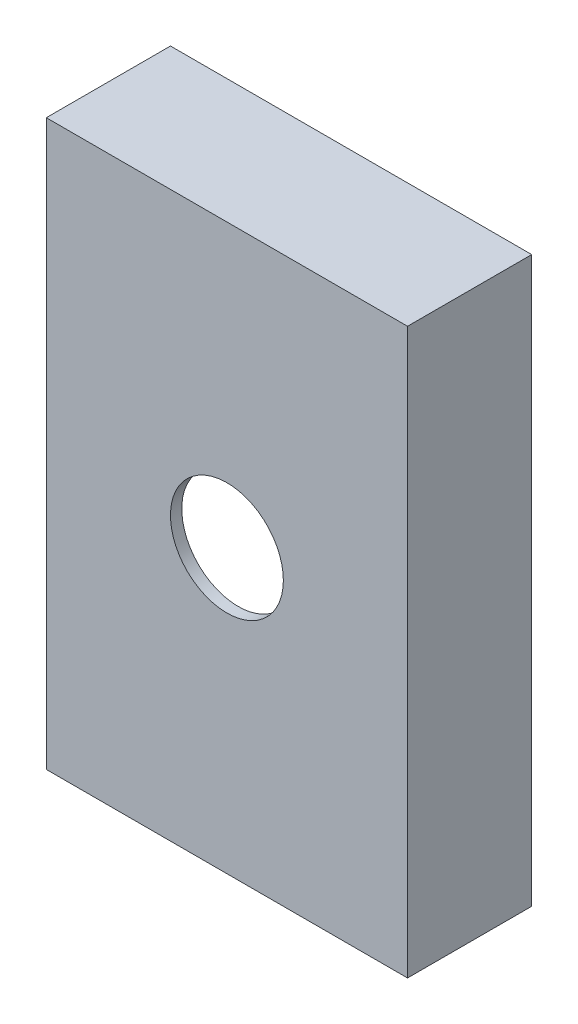
ISO-10303-21;
HEADER;
FILE_DESCRIPTION(('STEP AP214'),'2;1');
FILE_NAME('part.step','',(''),(''),'','','');
FILE_SCHEMA(('AUTOMOTIVE_DESIGN { 1 0 10303 214 1 1 1 1 }'));
ENDSEC;
DATA;
#1=APPLICATION_CONTEXT('core data for automotive mechanical design processes');
#2=APPLICATION_PROTOCOL_DEFINITION('international standard','automotive_design',2000,#1);
#3=PRODUCT_CONTEXT('',#1,'mechanical');
#4=PRODUCT('Part','Part','',(#3));
#5=PRODUCT_RELATED_PRODUCT_CATEGORY('part','',(#4));
#6=PRODUCT_DEFINITION_FORMATION('','',#4);
#7=PRODUCT_DEFINITION_CONTEXT('part definition',#1,'design');
#8=PRODUCT_DEFINITION('design','',#6,#7);
#9=PRODUCT_DEFINITION_SHAPE('','',#8);
#10=(LENGTH_UNIT() NAMED_UNIT(*) SI_UNIT(.MILLI.,.METRE.));
#11=(NAMED_UNIT(*) PLANE_ANGLE_UNIT() SI_UNIT($,.RADIAN.));
#12=(NAMED_UNIT(*) SI_UNIT($,.STERADIAN.) SOLID_ANGLE_UNIT());
#13=UNCERTAINTY_MEASURE_WITH_UNIT(LENGTH_MEASURE(1.E-05),#10,'distance_accuracy_value','');
#14=(GEOMETRIC_REPRESENTATION_CONTEXT(3) GLOBAL_UNCERTAINTY_ASSIGNED_CONTEXT((#13)) GLOBAL_UNIT_ASSIGNED_CONTEXT((#10,
#11,#12)) REPRESENTATION_CONTEXT('',''));
#15=CARTESIAN_POINT('',(0.,0.,0.));
#16=DIRECTION('',(0.,0.,1.));
#17=DIRECTION('',(1.,0.,0.));
#18=AXIS2_PLACEMENT_3D('',#15,#16,#17);
#19=CARTESIAN_POINT('',(0.,0.,0.));
#20=DIRECTION('',(0.,0.,1.));
#21=DIRECTION('',(1.,0.,0.));
#22=AXIS2_PLACEMENT_3D('',#19,#20,#21);
#23=PLANE('',#22);
#24=DIRECTION('',(0.,1.,0.));
#25=VECTOR('',#24,1.);
#26=CARTESIAN_POINT('',(0.,0.,0.));
#27=LINE('',#26,#25);
#28=CARTESIAN_POINT('',(0.,0.,0.));
#29=VERTEX_POINT('',#28);
#30=CARTESIAN_POINT('',(0.,250.,0.));
#31=VERTEX_POINT('',#30);
#32=EDGE_CURVE('E161',#29,#31,#27,.T.);
#33=ORIENTED_EDGE('',*,*,#32,.F.);
#34=DIRECTION('',(1.,0.,0.));
#35=VECTOR('',#34,1.);
#36=CARTESIAN_POINT('',(0.,0.,0.));
#37=LINE('',#36,#35);
#38=CARTESIAN_POINT('',(-160.,0.,0.));
#39=VERTEX_POINT('',#38);
#40=EDGE_CURVE('E56',#39,#29,#37,.T.);
#41=ORIENTED_EDGE('',*,*,#40,.F.);
#42=DIRECTION('',(0.,-1.,0.));
#43=VECTOR('',#42,1.);
#44=CARTESIAN_POINT('',(-160.,0.,0.));
#45=LINE('',#44,#43);
#46=CARTESIAN_POINT('',(-160.,250.,0.));
#47=VERTEX_POINT('',#46);
#48=EDGE_CURVE('E107',#47,#39,#45,.T.);
#49=ORIENTED_EDGE('',*,*,#48,.F.);
#50=DIRECTION('',(-1.,0.,0.));
#51=VECTOR('',#50,1.);
#52=CARTESIAN_POINT('',(0.,250.,0.));
#53=LINE('',#52,#51);
#54=EDGE_CURVE('E164',#31,#47,#53,.T.);
#55=ORIENTED_EDGE('',*,*,#54,.F.);
#56=EDGE_LOOP('',(#33,#41,#49,#55));
#57=FACE_BOUND('',#56,.T.);
#58=DIRECTION('',(0.,1.,0.));
#59=VECTOR('',#58,1.);
#60=CARTESIAN_POINT('',(-5.,5.,0.));
#61=LINE('',#60,#59);
#62=CARTESIAN_POINT('',(-5.,5.,0.));
#63=VERTEX_POINT('',#62);
#64=CARTESIAN_POINT('',(-5.,245.,0.));
#65=VERTEX_POINT('',#64);
#66=EDGE_CURVE('E48',#63,#65,#61,.T.);
#67=ORIENTED_EDGE('',*,*,#66,.T.);
#68=DIRECTION('',(-1.,0.,0.));
#69=VECTOR('',#68,1.);
#70=CARTESIAN_POINT('',(-5.,245.,0.));
#71=LINE('',#70,#69);
#72=CARTESIAN_POINT('',(-155.,245.,0.));
#73=VERTEX_POINT('',#72);
#74=EDGE_CURVE('E146',#65,#73,#71,.T.);
#75=ORIENTED_EDGE('',*,*,#74,.T.);
#76=DIRECTION('',(0.,-1.,0.));
#77=VECTOR('',#76,1.);
#78=CARTESIAN_POINT('',(-155.,5.,0.));
#79=LINE('',#78,#77);
#80=CARTESIAN_POINT('',(-155.,5.,0.));
#81=VERTEX_POINT('',#80);
#82=EDGE_CURVE('E149',#73,#81,#79,.T.);
#83=ORIENTED_EDGE('',*,*,#82,.T.);
#84=DIRECTION('',(1.,0.,0.));
#85=VECTOR('',#84,1.);
#86=CARTESIAN_POINT('',(-5.,5.,0.));
#87=LINE('',#86,#85);
#88=EDGE_CURVE('E135',#81,#63,#87,.T.);
#89=ORIENTED_EDGE('',*,*,#88,.T.);
#90=EDGE_LOOP('',(#67,#75,#83,#89));
#91=FACE_BOUND('',#90,.T.);
#92=ADVANCED_FACE('F33',(#57,#91),#23,.F.);
#93=CARTESIAN_POINT('',(0.,0.,50.));
#94=DIRECTION('',(-1.,0.,0.));
#95=DIRECTION('',(0.,-1.,0.));
#96=AXIS2_PLACEMENT_3D('',#93,#94,#95);
#97=PLANE('',#96);
#98=ORIENTED_EDGE('',*,*,#32,.T.);
#99=DIRECTION('',(0.,0.,-1.));
#100=VECTOR('',#99,1.);
#101=CARTESIAN_POINT('',(0.,250.,50.));
#102=LINE('',#101,#100);
#103=CARTESIAN_POINT('',(0.,250.,55.));
#104=VERTEX_POINT('',#103);
#105=EDGE_CURVE('E11',#104,#31,#102,.T.);
#106=ORIENTED_EDGE('',*,*,#105,.F.);
#107=DIRECTION('',(0.,1.,0.));
#108=VECTOR('',#107,1.);
#109=CARTESIAN_POINT('',(0.,250.,55.));
#110=LINE('',#109,#108);
#111=CARTESIAN_POINT('',(0.,0.,55.));
#112=VERTEX_POINT('',#111);
#113=EDGE_CURVE('E116',#112,#104,#110,.T.);
#114=ORIENTED_EDGE('',*,*,#113,.F.);
#115=DIRECTION('',(0.,0.,-1.));
#116=VECTOR('',#115,1.);
#117=CARTESIAN_POINT('',(0.,0.,50.));
#118=LINE('',#117,#116);
#119=EDGE_CURVE('E108',#112,#29,#118,.T.);
#120=ORIENTED_EDGE('',*,*,#119,.T.);
#121=EDGE_LOOP('',(#98,#106,#114,#120));
#122=FACE_BOUND('',#121,.T.);
#123=ADVANCED_FACE('F35',(#122),#97,.F.);
#124=CARTESIAN_POINT('',(0.,250.,50.));
#125=DIRECTION('',(0.,-1.,0.));
#126=DIRECTION('',(1.,0.,0.));
#127=AXIS2_PLACEMENT_3D('',#124,#125,#126);
#128=PLANE('',#127);
#129=ORIENTED_EDGE('',*,*,#54,.T.);
#130=DIRECTION('',(0.,0.,-1.));
#131=VECTOR('',#130,1.);
#132=CARTESIAN_POINT('',(-160.,250.,50.));
#133=LINE('',#132,#131);
#134=CARTESIAN_POINT('',(-160.,250.,55.));
#135=VERTEX_POINT('',#134);
#136=EDGE_CURVE('E41',#135,#47,#133,.T.);
#137=ORIENTED_EDGE('',*,*,#136,.F.);
#138=DIRECTION('',(-1.,0.,0.));
#139=VECTOR('',#138,1.);
#140=CARTESIAN_POINT('',(-160.,250.,55.));
#141=LINE('',#140,#139);
#142=EDGE_CURVE('E121',#104,#135,#141,.T.);
#143=ORIENTED_EDGE('',*,*,#142,.F.);
#144=ORIENTED_EDGE('',*,*,#105,.T.);
#145=EDGE_LOOP('',(#129,#137,#143,#144));
#146=FACE_BOUND('',#145,.T.);
#147=ADVANCED_FACE('F173',(#146),#128,.F.);
#148=CARTESIAN_POINT('',(-160.,0.,50.));
#149=DIRECTION('',(1.,0.,0.));
#150=DIRECTION('',(0.,1.,0.));
#151=AXIS2_PLACEMENT_3D('',#148,#149,#150);
#152=PLANE('',#151);
#153=ORIENTED_EDGE('',*,*,#48,.T.);
#154=DIRECTION('',(0.,0.,-1.));
#155=VECTOR('',#154,1.);
#156=CARTESIAN_POINT('',(-160.,0.,50.));
#157=LINE('',#156,#155);
#158=CARTESIAN_POINT('',(-160.,0.,55.));
#159=VERTEX_POINT('',#158);
#160=EDGE_CURVE('E100',#159,#39,#157,.T.);
#161=ORIENTED_EDGE('',*,*,#160,.F.);
#162=DIRECTION('',(0.,-1.,0.));
#163=VECTOR('',#162,1.);
#164=CARTESIAN_POINT('',(-160.,250.,55.));
#165=LINE('',#164,#163);
#166=EDGE_CURVE('E105',#135,#159,#165,.T.);
#167=ORIENTED_EDGE('',*,*,#166,.F.);
#168=ORIENTED_EDGE('',*,*,#136,.T.);
#169=EDGE_LOOP('',(#153,#161,#167,#168));
#170=FACE_BOUND('',#169,.T.);
#171=ADVANCED_FACE('F102',(#170),#152,.F.);
#172=CARTESIAN_POINT('',(0.,0.,50.));
#173=DIRECTION('',(0.,1.,0.));
#174=DIRECTION('',(-1.,0.,0.));
#175=AXIS2_PLACEMENT_3D('',#172,#173,#174);
#176=PLANE('',#175);
#177=ORIENTED_EDGE('',*,*,#40,.T.);
#178=ORIENTED_EDGE('',*,*,#119,.F.);
#179=DIRECTION('',(1.,0.,0.));
#180=VECTOR('',#179,1.);
#181=CARTESIAN_POINT('',(-160.,0.,55.));
#182=LINE('',#181,#180);
#183=EDGE_CURVE('E111',#159,#112,#182,.T.);
#184=ORIENTED_EDGE('',*,*,#183,.F.);
#185=ORIENTED_EDGE('',*,*,#160,.T.);
#186=EDGE_LOOP('',(#177,#178,#184,#185));
#187=FACE_BOUND('',#186,.T.);
#188=ADVANCED_FACE('F112',(#187),#176,.F.);
#189=CARTESIAN_POINT('',(-5.,5.,50.));
#190=DIRECTION('',(-1.,0.,0.));
#191=DIRECTION('',(0.,0.,1.));
#192=AXIS2_PLACEMENT_3D('',#189,#190,#191);
#193=PLANE('',#192);
#194=ORIENTED_EDGE('',*,*,#66,.F.);
#195=DIRECTION('',(0.,0.,-1.));
#196=VECTOR('',#195,1.);
#197=CARTESIAN_POINT('',(-5.,5.,50.));
#198=LINE('',#197,#196);
#199=CARTESIAN_POINT('',(-5.,5.,50.));
#200=VERTEX_POINT('',#199);
#201=EDGE_CURVE('E144',#200,#63,#198,.T.);
#202=ORIENTED_EDGE('',*,*,#201,.F.);
#203=DIRECTION('',(0.,1.,0.));
#204=VECTOR('',#203,1.);
#205=CARTESIAN_POINT('',(-5.,5.,50.));
#206=LINE('',#205,#204);
#207=CARTESIAN_POINT('',(-5.,245.,50.));
#208=VERTEX_POINT('',#207);
#209=EDGE_CURVE('E131',#200,#208,#206,.T.);
#210=ORIENTED_EDGE('',*,*,#209,.T.);
#211=DIRECTION('',(0.,0.,-1.));
#212=VECTOR('',#211,1.);
#213=CARTESIAN_POINT('',(-5.,245.,50.));
#214=LINE('',#213,#212);
#215=EDGE_CURVE('E159',#208,#65,#214,.T.);
#216=ORIENTED_EDGE('',*,*,#215,.T.);
#217=EDGE_LOOP('',(#194,#202,#210,#216));
#218=FACE_BOUND('',#217,.T.);
#219=ADVANCED_FACE('F186',(#218),#193,.T.);
#220=CARTESIAN_POINT('',(-5.,245.,50.));
#221=DIRECTION('',(0.,-1.,0.));
#222=DIRECTION('',(1.,0.,0.));
#223=AXIS2_PLACEMENT_3D('',#220,#221,#222);
#224=PLANE('',#223);
#225=ORIENTED_EDGE('',*,*,#74,.F.);
#226=ORIENTED_EDGE('',*,*,#215,.F.);
#227=DIRECTION('',(-1.,0.,0.));
#228=VECTOR('',#227,1.);
#229=CARTESIAN_POINT('',(-5.,245.,50.));
#230=LINE('',#229,#228);
#231=CARTESIAN_POINT('',(-155.,245.,50.));
#232=VERTEX_POINT('',#231);
#233=EDGE_CURVE('E134',#208,#232,#230,.T.);
#234=ORIENTED_EDGE('',*,*,#233,.T.);
#235=DIRECTION('',(0.,0.,-1.));
#236=VECTOR('',#235,1.);
#237=CARTESIAN_POINT('',(-155.,245.,50.));
#238=LINE('',#237,#236);
#239=EDGE_CURVE('E157',#232,#73,#238,.T.);
#240=ORIENTED_EDGE('',*,*,#239,.T.);
#241=EDGE_LOOP('',(#225,#226,#234,#240));
#242=FACE_BOUND('',#241,.T.);
#243=ADVANCED_FACE('F192',(#242),#224,.T.);
#244=CARTESIAN_POINT('',(-155.,5.,50.));
#245=DIRECTION('',(1.,0.,0.));
#246=DIRECTION('',(0.,0.,-1.));
#247=AXIS2_PLACEMENT_3D('',#244,#245,#246);
#248=PLANE('',#247);
#249=ORIENTED_EDGE('',*,*,#82,.F.);
#250=ORIENTED_EDGE('',*,*,#239,.F.);
#251=DIRECTION('',(0.,-1.,0.));
#252=VECTOR('',#251,1.);
#253=CARTESIAN_POINT('',(-155.,5.,50.));
#254=LINE('',#253,#252);
#255=CARTESIAN_POINT('',(-155.,5.,50.));
#256=VERTEX_POINT('',#255);
#257=EDGE_CURVE('E138',#232,#256,#254,.T.);
#258=ORIENTED_EDGE('',*,*,#257,.T.);
#259=DIRECTION('',(0.,0.,-1.));
#260=VECTOR('',#259,1.);
#261=CARTESIAN_POINT('',(-155.,5.,50.));
#262=LINE('',#261,#260);
#263=EDGE_CURVE('E155',#256,#81,#262,.T.);
#264=ORIENTED_EDGE('',*,*,#263,.T.);
#265=EDGE_LOOP('',(#249,#250,#258,#264));
#266=FACE_BOUND('',#265,.T.);
#267=ADVANCED_FACE('F196',(#266),#248,.T.);
#268=CARTESIAN_POINT('',(-5.,5.,50.));
#269=DIRECTION('',(0.,1.,0.));
#270=DIRECTION('',(0.,0.,1.));
#271=AXIS2_PLACEMENT_3D('',#268,#269,#270);
#272=PLANE('',#271);
#273=ORIENTED_EDGE('',*,*,#88,.F.);
#274=ORIENTED_EDGE('',*,*,#263,.F.);
#275=DIRECTION('',(1.,0.,0.));
#276=VECTOR('',#275,1.);
#277=CARTESIAN_POINT('',(-5.,5.,50.));
#278=LINE('',#277,#276);
#279=EDGE_CURVE('E141',#256,#200,#278,.T.);
#280=ORIENTED_EDGE('',*,*,#279,.T.);
#281=ORIENTED_EDGE('',*,*,#201,.T.);
#282=EDGE_LOOP('',(#273,#274,#280,#281));
#283=FACE_BOUND('',#282,.T.);
#284=ADVANCED_FACE('F201',(#283),#272,.T.);
#285=CARTESIAN_POINT('',(0.,0.,50.));
#286=DIRECTION('',(0.,0.,1.));
#287=DIRECTION('',(1.,0.,0.));
#288=AXIS2_PLACEMENT_3D('',#285,#286,#287);
#289=PLANE('',#288);
#290=CARTESIAN_POINT('',(-80.,125.,50.));
#291=DIRECTION('',(0.,0.,1.));
#292=DIRECTION('',(1.,0.,0.));
#293=AXIS2_PLACEMENT_3D('',#290,#291,#292);
#294=CIRCLE('',#293,25.);
#295=CARTESIAN_POINT('',(-55.,125.,50.));
#296=VERTEX_POINT('',#295);
#297=EDGE_CURVE('E122',#296,#296,#294,.T.);
#298=ORIENTED_EDGE('',*,*,#297,.T.);
#299=EDGE_LOOP('',(#298));
#300=FACE_BOUND('',#299,.T.);
#301=ORIENTED_EDGE('',*,*,#209,.F.);
#302=ORIENTED_EDGE('',*,*,#279,.F.);
#303=ORIENTED_EDGE('',*,*,#257,.F.);
#304=ORIENTED_EDGE('',*,*,#233,.F.);
#305=EDGE_LOOP('',(#301,#302,#303,#304));
#306=FACE_BOUND('',#305,.T.);
#307=ADVANCED_FACE('F207',(#300,#306),#289,.F.);
#308=CARTESIAN_POINT('',(0.,0.,55.));
#309=DIRECTION('',(0.,0.,1.));
#310=DIRECTION('',(1.,0.,0.));
#311=AXIS2_PLACEMENT_3D('',#308,#309,#310);
#312=PLANE('',#311);
#313=CARTESIAN_POINT('',(-80.,125.,55.));
#314=DIRECTION('',(0.,0.,1.));
#315=DIRECTION('',(1.,0.,0.));
#316=AXIS2_PLACEMENT_3D('',#313,#314,#315);
#317=CIRCLE('',#316,25.);
#318=CARTESIAN_POINT('',(-55.,125.,55.));
#319=VERTEX_POINT('',#318);
#320=EDGE_CURVE('E125',#319,#319,#317,.T.);
#321=ORIENTED_EDGE('',*,*,#320,.F.);
#322=EDGE_LOOP('',(#321));
#323=FACE_BOUND('',#322,.T.);
#324=ORIENTED_EDGE('',*,*,#166,.T.);
#325=ORIENTED_EDGE('',*,*,#183,.T.);
#326=ORIENTED_EDGE('',*,*,#113,.T.);
#327=ORIENTED_EDGE('',*,*,#142,.T.);
#328=EDGE_LOOP('',(#324,#325,#326,#327));
#329=FACE_BOUND('',#328,.T.);
#330=ADVANCED_FACE('F119',(#323,#329),#312,.T.);
#331=CARTESIAN_POINT('',(-80.,125.,45.));
#332=DIRECTION('',(0.,0.,1.));
#333=DIRECTION('',(1.,0.,0.));
#334=AXIS2_PLACEMENT_3D('',#331,#332,#333);
#335=CYLINDRICAL_SURFACE('',#334,25.);
#336=ORIENTED_EDGE('',*,*,#320,.T.);
#337=EDGE_LOOP('',(#336));
#338=FACE_BOUND('',#337,.T.);
#339=ORIENTED_EDGE('',*,*,#297,.F.);
#340=EDGE_LOOP('',(#339));
#341=FACE_BOUND('',#340,.T.);
#342=ADVANCED_FACE('F214',(#338,#341),#335,.F.);
#343=CLOSED_SHELL('',(#92,#123,#147,#171,#188,#219,#243,#267,#284,#307,#330,#342));
#344=MANIFOLD_SOLID_BREP('B2',#343);
#345=ADVANCED_BREP_SHAPE_REPRESENTATION('',(#18,#344),#14);
#346=SHAPE_DEFINITION_REPRESENTATION(#9,#345);
ENDSEC;
END-ISO-10303-21;
